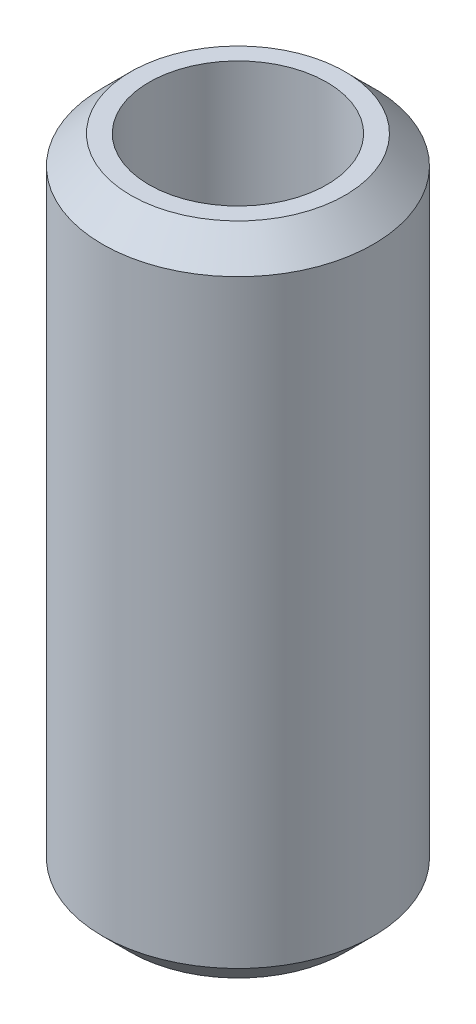
ISO-10303-21;
HEADER;
FILE_DESCRIPTION(('STEP AP214'),'2;1');
FILE_NAME('part.step','',(''),(''),'','','');
FILE_SCHEMA(('AUTOMOTIVE_DESIGN { 1 0 10303 214 1 1 1 1 }'));
ENDSEC;
DATA;
#1=APPLICATION_CONTEXT('core data for automotive mechanical design processes');
#2=APPLICATION_PROTOCOL_DEFINITION('international standard','automotive_design',2000,#1);
#3=PRODUCT_CONTEXT('',#1,'mechanical');
#4=PRODUCT('Part','Part','',(#3));
#5=PRODUCT_RELATED_PRODUCT_CATEGORY('part','',(#4));
#6=PRODUCT_DEFINITION_FORMATION('','',#4);
#7=PRODUCT_DEFINITION_CONTEXT('part definition',#1,'design');
#8=PRODUCT_DEFINITION('design','',#6,#7);
#9=PRODUCT_DEFINITION_SHAPE('','',#8);
#10=(LENGTH_UNIT() NAMED_UNIT(*) SI_UNIT(.MILLI.,.METRE.));
#11=(NAMED_UNIT(*) PLANE_ANGLE_UNIT() SI_UNIT($,.RADIAN.));
#12=(NAMED_UNIT(*) SI_UNIT($,.STERADIAN.) SOLID_ANGLE_UNIT());
#13=UNCERTAINTY_MEASURE_WITH_UNIT(LENGTH_MEASURE(1.E-05),#10,'distance_accuracy_value','');
#14=(GEOMETRIC_REPRESENTATION_CONTEXT(3) GLOBAL_UNCERTAINTY_ASSIGNED_CONTEXT((#13)) GLOBAL_UNIT_ASSIGNED_CONTEXT((#10,
#11,#12)) REPRESENTATION_CONTEXT('',''));
#15=CARTESIAN_POINT('',(0.,0.,0.));
#16=DIRECTION('',(0.,0.,1.));
#17=DIRECTION('',(1.,0.,0.));
#18=AXIS2_PLACEMENT_3D('',#15,#16,#17);
#19=CARTESIAN_POINT('',(0.,108.923869522935,0.));
#20=DIRECTION('',(0.,-1.,0.));
#21=DIRECTION('',(0.,0.,-1.));
#22=AXIS2_PLACEMENT_3D('',#19,#20,#21);
#23=CYLINDRICAL_SURFACE('',#22,22.5);
#24=CARTESIAN_POINT('',(0.,104.223623665433,0.));
#25=DIRECTION('',(0.,1.,0.));
#26=DIRECTION('',(0.,0.,1.));
#27=AXIS2_PLACEMENT_3D('',#24,#25,#26);
#28=CIRCLE('',#27,22.5);
#29=CARTESIAN_POINT('',(0.,104.223623665433,22.5));
#30=VERTEX_POINT('',#29);
#31=EDGE_CURVE('E50',#30,#30,#28,.F.);
#32=ORIENTED_EDGE('',*,*,#31,.T.);
#33=EDGE_LOOP('',(#32));
#34=FACE_BOUND('',#33,.T.);
#35=CARTESIAN_POINT('',(0.,4.70024585750246,0.));
#36=DIRECTION('',(0.,1.,0.));
#37=DIRECTION('',(0.,0.,1.));
#38=AXIS2_PLACEMENT_3D('',#35,#36,#37);
#39=CIRCLE('',#38,22.5);
#40=CARTESIAN_POINT('',(0.,4.70024585750246,22.5));
#41=VERTEX_POINT('',#40);
#42=EDGE_CURVE('E51',#41,#41,#39,.T.);
#43=ORIENTED_EDGE('',*,*,#42,.T.);
#44=EDGE_LOOP('',(#43));
#45=FACE_BOUND('',#44,.T.);
#46=ADVANCED_FACE('F39',(#34,#45),#23,.T.);
#47=CARTESIAN_POINT('',(0.,108.923869522935,0.));
#48=DIRECTION('',(0.,1.,0.));
#49=DIRECTION('',(0.,0.,1.));
#50=AXIS2_PLACEMENT_3D('',#47,#48,#49);
#51=PLANE('',#50);
#52=CARTESIAN_POINT('',(0.,108.923869522935,0.));
#53=DIRECTION('',(0.,1.,0.));
#54=DIRECTION('',(0.,0.,1.));
#55=AXIS2_PLACEMENT_3D('',#52,#53,#54);
#56=CIRCLE('',#55,17.7997541424975);
#57=CARTESIAN_POINT('',(0.,108.923869522935,17.7997541424975));
#58=VERTEX_POINT('',#57);
#59=EDGE_CURVE('E54',#58,#58,#56,.T.);
#60=ORIENTED_EDGE('',*,*,#59,.T.);
#61=EDGE_LOOP('',(#60));
#62=FACE_BOUND('',#61,.T.);
#63=CARTESIAN_POINT('',(0.,108.923869522935,0.));
#64=DIRECTION('',(0.,1.,0.));
#65=DIRECTION('',(0.,0.,1.));
#66=AXIS2_PLACEMENT_3D('',#63,#64,#65);
#67=CIRCLE('',#66,14.7650111880111);
#68=CARTESIAN_POINT('',(0.,108.923869522935,14.7650111880111));
#69=VERTEX_POINT('',#68);
#70=EDGE_CURVE('E58',#69,#69,#67,.T.);
#71=ORIENTED_EDGE('',*,*,#70,.F.);
#72=EDGE_LOOP('',(#71));
#73=FACE_BOUND('',#72,.T.);
#74=ADVANCED_FACE('F69',(#62,#73),#51,.T.);
#75=CARTESIAN_POINT('',(0.,0.,0.));
#76=DIRECTION('',(0.,1.,0.));
#77=DIRECTION('',(0.,0.,1.));
#78=AXIS2_PLACEMENT_3D('',#75,#76,#77);
#79=PLANE('',#78);
#80=CARTESIAN_POINT('',(0.,0.,0.));
#81=DIRECTION('',(0.,1.,0.));
#82=DIRECTION('',(0.,0.,1.));
#83=AXIS2_PLACEMENT_3D('',#80,#81,#82);
#84=CIRCLE('',#83,17.7997541424975);
#85=CARTESIAN_POINT('',(0.,0.,17.7997541424975));
#86=VERTEX_POINT('',#85);
#87=EDGE_CURVE('E10',#86,#86,#84,.F.);
#88=ORIENTED_EDGE('',*,*,#87,.T.);
#89=EDGE_LOOP('',(#88));
#90=FACE_BOUND('',#89,.T.);
#91=CARTESIAN_POINT('',(0.,0.,0.));
#92=DIRECTION('',(0.,1.,0.));
#93=DIRECTION('',(0.,0.,1.));
#94=AXIS2_PLACEMENT_3D('',#91,#92,#93);
#95=CIRCLE('',#94,14.7650111880111);
#96=CARTESIAN_POINT('',(0.,0.,14.7650111880111));
#97=VERTEX_POINT('',#96);
#98=EDGE_CURVE('E63',#97,#97,#95,.T.);
#99=ORIENTED_EDGE('',*,*,#98,.T.);
#100=EDGE_LOOP('',(#99));
#101=FACE_BOUND('',#100,.T.);
#102=ADVANCED_FACE('F75',(#90,#101),#79,.F.);
#103=CARTESIAN_POINT('',(0.,108.923869522935,0.));
#104=DIRECTION('',(0.,-1.,0.));
#105=DIRECTION('',(0.,0.,-1.));
#106=AXIS2_PLACEMENT_3D('',#103,#104,#105);
#107=CYLINDRICAL_SURFACE('',#106,14.7650111880111);
#108=ORIENTED_EDGE('',*,*,#70,.T.);
#109=EDGE_LOOP('',(#108));
#110=FACE_BOUND('',#109,.T.);
#111=ORIENTED_EDGE('',*,*,#98,.F.);
#112=EDGE_LOOP('',(#111));
#113=FACE_BOUND('',#112,.T.);
#114=ADVANCED_FACE('F70',(#110,#113),#107,.F.);
#115=CARTESIAN_POINT('',(0.,108.923869522935,0.));
#116=DIRECTION('',(0.,-1.,0.));
#117=DIRECTION('',(0.,0.,-1.));
#118=AXIS2_PLACEMENT_3D('',#115,#116,#117);
#119=CONICAL_SURFACE('',#118,17.7997541424975,0.785398163397446);
#120=ORIENTED_EDGE('',*,*,#31,.F.);
#121=EDGE_LOOP('',(#120));
#122=FACE_BOUND('',#121,.T.);
#123=ORIENTED_EDGE('',*,*,#59,.F.);
#124=EDGE_LOOP('',(#123));
#125=FACE_BOUND('',#124,.T.);
#126=ADVANCED_FACE('F81',(#122,#125),#119,.T.);
#127=CARTESIAN_POINT('',(0.,4.70024585750246,0.));
#128=DIRECTION('',(0.,1.,0.));
#129=DIRECTION('',(0.,0.,1.));
#130=AXIS2_PLACEMENT_3D('',#127,#128,#129);
#131=CONICAL_SURFACE('',#130,22.5,0.785398163397453);
#132=ORIENTED_EDGE('',*,*,#87,.F.);
#133=EDGE_LOOP('',(#132));
#134=FACE_BOUND('',#133,.T.);
#135=ORIENTED_EDGE('',*,*,#42,.F.);
#136=EDGE_LOOP('',(#135));
#137=FACE_BOUND('',#136,.T.);
#138=ADVANCED_FACE('F45',(#134,#137),#131,.T.);
#139=CLOSED_SHELL('',(#46,#74,#102,#114,#126,#138));
#140=MANIFOLD_SOLID_BREP('B2',#139);
#141=ADVANCED_BREP_SHAPE_REPRESENTATION('',(#18,#140),#14);
#142=SHAPE_DEFINITION_REPRESENTATION(#9,#141);
ENDSEC;
END-ISO-10303-21;
